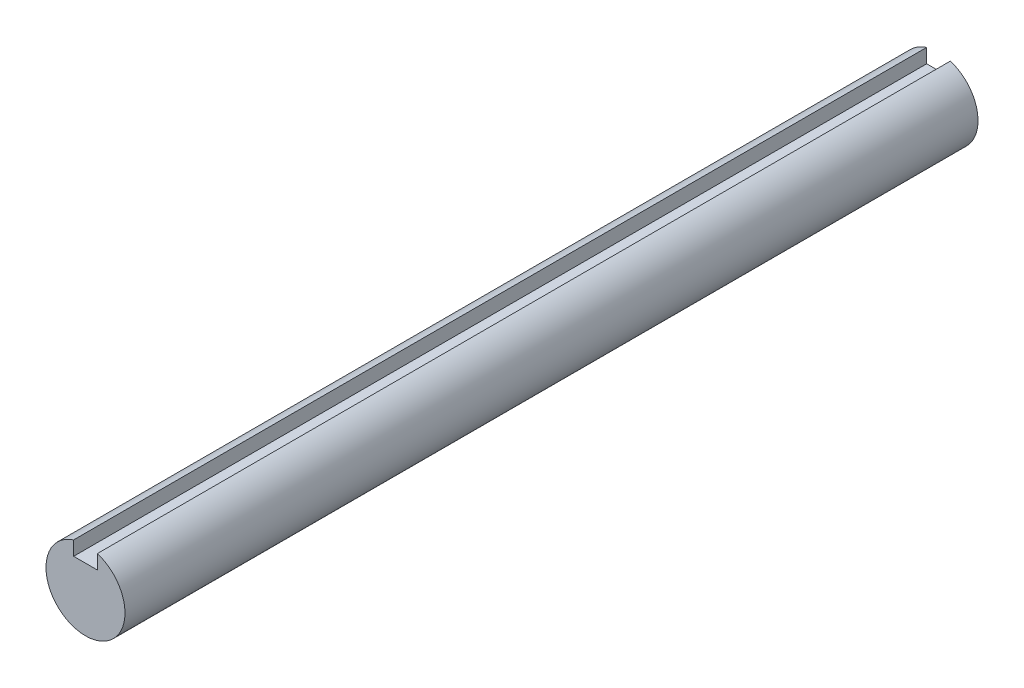
ISO-10303-21;
HEADER;
FILE_DESCRIPTION(('STEP AP214'),'2;1');
FILE_NAME('part.step','',(''),(''),'','','');
FILE_SCHEMA(('AUTOMOTIVE_DESIGN { 1 0 10303 214 1 1 1 1 }'));
ENDSEC;
DATA;
#1=APPLICATION_CONTEXT('core data for automotive mechanical design processes');
#2=APPLICATION_PROTOCOL_DEFINITION('international standard','automotive_design',2000,#1);
#3=PRODUCT_CONTEXT('',#1,'mechanical');
#4=PRODUCT('Part','Part','',(#3));
#5=PRODUCT_RELATED_PRODUCT_CATEGORY('part','',(#4));
#6=PRODUCT_DEFINITION_FORMATION('','',#4);
#7=PRODUCT_DEFINITION_CONTEXT('part definition',#1,'design');
#8=PRODUCT_DEFINITION('design','',#6,#7);
#9=PRODUCT_DEFINITION_SHAPE('','',#8);
#10=(LENGTH_UNIT() NAMED_UNIT(*) SI_UNIT(.MILLI.,.METRE.));
#11=(NAMED_UNIT(*) PLANE_ANGLE_UNIT() SI_UNIT($,.RADIAN.));
#12=(NAMED_UNIT(*) SI_UNIT($,.STERADIAN.) SOLID_ANGLE_UNIT());
#13=UNCERTAINTY_MEASURE_WITH_UNIT(LENGTH_MEASURE(1.E-05),#10,'distance_accuracy_value','');
#14=(GEOMETRIC_REPRESENTATION_CONTEXT(3) GLOBAL_UNCERTAINTY_ASSIGNED_CONTEXT((#13)) GLOBAL_UNIT_ASSIGNED_CONTEXT((#10,
#11,#12)) REPRESENTATION_CONTEXT('',''));
#15=CARTESIAN_POINT('',(0.,0.,0.));
#16=DIRECTION('',(0.,0.,1.));
#17=DIRECTION('',(1.,0.,0.));
#18=AXIS2_PLACEMENT_3D('',#15,#16,#17);
#19=CARTESIAN_POINT('',(0.,0.,53.975));
#20=DIRECTION('',(0.,0.,-1.));
#21=DIRECTION('',(-1.,0.,0.));
#22=AXIS2_PLACEMENT_3D('',#19,#20,#21);
#23=CYLINDRICAL_SURFACE('',#22,5.00000000000007);
#24=DIRECTION('',(0.,0.,-1.));
#25=VECTOR('',#24,1.);
#26=CARTESIAN_POINT('',(-1.5,4.7696960070848,53.975));
#27=LINE('',#26,#25);
#28=CARTESIAN_POINT('',(-1.5,4.7696960070848,53.975));
#29=VERTEX_POINT('',#28);
#30=CARTESIAN_POINT('',(-1.5,4.7696960070848,-53.975));
#31=VERTEX_POINT('',#30);
#32=EDGE_CURVE('E94',#29,#31,#27,.T.);
#33=ORIENTED_EDGE('',*,*,#32,.T.);
#34=CARTESIAN_POINT('',(0.,0.,-53.975));
#35=DIRECTION('',(0.,0.,1.));
#36=DIRECTION('',(1.,0.,0.));
#37=AXIS2_PLACEMENT_3D('',#34,#35,#36);
#38=CIRCLE('',#37,5.00000000000007);
#39=CARTESIAN_POINT('',(1.5,4.7696960070848,-53.975));
#40=VERTEX_POINT('',#39);
#41=EDGE_CURVE('E89',#31,#40,#38,.T.);
#42=ORIENTED_EDGE('',*,*,#41,.T.);
#43=DIRECTION('',(0.,0.,-1.));
#44=VECTOR('',#43,1.);
#45=CARTESIAN_POINT('',(1.5,4.7696960070848,53.975));
#46=LINE('',#45,#44);
#47=CARTESIAN_POINT('',(1.5,4.7696960070848,53.975));
#48=VERTEX_POINT('',#47);
#49=EDGE_CURVE('E11',#48,#40,#46,.T.);
#50=ORIENTED_EDGE('',*,*,#49,.F.);
#51=CARTESIAN_POINT('',(0.,0.,53.975));
#52=DIRECTION('',(0.,0.,1.));
#53=DIRECTION('',(1.,0.,0.));
#54=AXIS2_PLACEMENT_3D('',#51,#52,#53);
#55=CIRCLE('',#54,5.00000000000007);
#56=EDGE_CURVE('E100',#29,#48,#55,.T.);
#57=ORIENTED_EDGE('',*,*,#56,.F.);
#58=EDGE_LOOP('',(#33,#42,#50,#57));
#59=FACE_BOUND('',#58,.T.);
#60=ADVANCED_FACE('F37',(#59),#23,.T.);
#61=CARTESIAN_POINT('',(1.5,2.9696960070848,53.975));
#62=DIRECTION('',(1.,0.,0.));
#63=DIRECTION('',(0.,0.,-1.));
#64=AXIS2_PLACEMENT_3D('',#61,#62,#63);
#65=PLANE('',#64);
#66=ORIENTED_EDGE('',*,*,#49,.T.);
#67=DIRECTION('',(0.,-1.,0.));
#68=VECTOR('',#67,1.);
#69=CARTESIAN_POINT('',(1.5,2.9696960070848,-53.975));
#70=LINE('',#69,#68);
#71=CARTESIAN_POINT('',(1.5,2.9696960070848,-53.975));
#72=VERTEX_POINT('',#71);
#73=EDGE_CURVE('E79',#40,#72,#70,.T.);
#74=ORIENTED_EDGE('',*,*,#73,.T.);
#75=DIRECTION('',(0.,0.,-1.));
#76=VECTOR('',#75,1.);
#77=CARTESIAN_POINT('',(1.5,2.9696960070848,53.975));
#78=LINE('',#77,#76);
#79=CARTESIAN_POINT('',(1.5,2.9696960070848,53.975));
#80=VERTEX_POINT('',#79);
#81=EDGE_CURVE('E44',#80,#72,#78,.T.);
#82=ORIENTED_EDGE('',*,*,#81,.F.);
#83=DIRECTION('',(0.,-1.,0.));
#84=VECTOR('',#83,1.);
#85=CARTESIAN_POINT('',(1.5,2.9696960070848,53.975));
#86=LINE('',#85,#84);
#87=EDGE_CURVE('E80',#48,#80,#86,.T.);
#88=ORIENTED_EDGE('',*,*,#87,.F.);
#89=EDGE_LOOP('',(#66,#74,#82,#88));
#90=FACE_BOUND('',#89,.T.);
#91=ADVANCED_FACE('F77',(#90),#65,.F.);
#92=CARTESIAN_POINT('',(1.5,2.9696960070848,53.975));
#93=DIRECTION('',(0.,-1.,0.));
#94=DIRECTION('',(0.,0.,-1.));
#95=AXIS2_PLACEMENT_3D('',#92,#93,#94);
#96=PLANE('',#95);
#97=ORIENTED_EDGE('',*,*,#81,.T.);
#98=DIRECTION('',(-1.,0.,0.));
#99=VECTOR('',#98,1.);
#100=CARTESIAN_POINT('',(1.5,2.9696960070848,-53.975));
#101=LINE('',#100,#99);
#102=CARTESIAN_POINT('',(-1.5,2.9696960070848,-53.975));
#103=VERTEX_POINT('',#102);
#104=EDGE_CURVE('E92',#72,#103,#101,.T.);
#105=ORIENTED_EDGE('',*,*,#104,.T.);
#106=DIRECTION('',(0.,0.,-1.));
#107=VECTOR('',#106,1.);
#108=CARTESIAN_POINT('',(-1.5,2.9696960070848,53.975));
#109=LINE('',#108,#107);
#110=CARTESIAN_POINT('',(-1.5,2.9696960070848,53.975));
#111=VERTEX_POINT('',#110);
#112=EDGE_CURVE('E106',#111,#103,#109,.T.);
#113=ORIENTED_EDGE('',*,*,#112,.F.);
#114=DIRECTION('',(-1.,0.,0.));
#115=VECTOR('',#114,1.);
#116=CARTESIAN_POINT('',(1.5,2.9696960070848,53.975));
#117=LINE('',#116,#115);
#118=EDGE_CURVE('E56',#80,#111,#117,.T.);
#119=ORIENTED_EDGE('',*,*,#118,.F.);
#120=EDGE_LOOP('',(#97,#105,#113,#119));
#121=FACE_BOUND('',#120,.T.);
#122=ADVANCED_FACE('F108',(#121),#96,.F.);
#123=CARTESIAN_POINT('',(-1.5,2.9696960070848,53.975));
#124=DIRECTION('',(-1.,0.,0.));
#125=DIRECTION('',(0.,0.,1.));
#126=AXIS2_PLACEMENT_3D('',#123,#124,#125);
#127=PLANE('',#126);
#128=ORIENTED_EDGE('',*,*,#112,.T.);
#129=DIRECTION('',(0.,1.,0.));
#130=VECTOR('',#129,1.);
#131=CARTESIAN_POINT('',(-1.5,2.9696960070848,-53.975));
#132=LINE('',#131,#130);
#133=EDGE_CURVE('E98',#103,#31,#132,.T.);
#134=ORIENTED_EDGE('',*,*,#133,.T.);
#135=ORIENTED_EDGE('',*,*,#32,.F.);
#136=DIRECTION('',(0.,1.,0.));
#137=VECTOR('',#136,1.);
#138=CARTESIAN_POINT('',(-1.5,2.9696960070848,53.975));
#139=LINE('',#138,#137);
#140=EDGE_CURVE('E51',#111,#29,#139,.T.);
#141=ORIENTED_EDGE('',*,*,#140,.F.);
#142=EDGE_LOOP('',(#128,#134,#135,#141));
#143=FACE_BOUND('',#142,.T.);
#144=ADVANCED_FACE('F110',(#143),#127,.F.);
#145=CARTESIAN_POINT('',(0.,0.,53.975));
#146=DIRECTION('',(0.,0.,1.));
#147=DIRECTION('',(1.,0.,0.));
#148=AXIS2_PLACEMENT_3D('',#145,#146,#147);
#149=PLANE('',#148);
#150=ORIENTED_EDGE('',*,*,#56,.T.);
#151=ORIENTED_EDGE('',*,*,#87,.T.);
#152=ORIENTED_EDGE('',*,*,#118,.T.);
#153=ORIENTED_EDGE('',*,*,#140,.T.);
#154=EDGE_LOOP('',(#150,#151,#152,#153));
#155=FACE_BOUND('',#154,.T.);
#156=ADVANCED_FACE('F111',(#155),#149,.T.);
#157=CARTESIAN_POINT('',(0.,0.,-53.975));
#158=DIRECTION('',(0.,0.,1.));
#159=DIRECTION('',(1.,0.,0.));
#160=AXIS2_PLACEMENT_3D('',#157,#158,#159);
#161=PLANE('',#160);
#162=ORIENTED_EDGE('',*,*,#41,.F.);
#163=ORIENTED_EDGE('',*,*,#133,.F.);
#164=ORIENTED_EDGE('',*,*,#104,.F.);
#165=ORIENTED_EDGE('',*,*,#73,.F.);
#166=EDGE_LOOP('',(#162,#163,#164,#165));
#167=FACE_BOUND('',#166,.T.);
#168=ADVANCED_FACE('F87',(#167),#161,.F.);
#169=CLOSED_SHELL('',(#60,#91,#122,#144,#156,#168));
#170=MANIFOLD_SOLID_BREP('B2',#169);
#171=ADVANCED_BREP_SHAPE_REPRESENTATION('',(#18,#170),#14);
#172=SHAPE_DEFINITION_REPRESENTATION(#9,#171);
ENDSEC;
END-ISO-10303-21;
